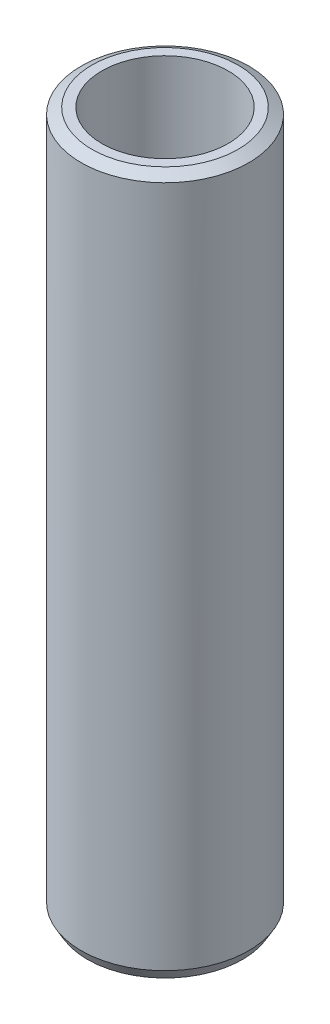
ISO-10303-21;
HEADER;
FILE_DESCRIPTION(('STEP AP214'),'2;1');
FILE_NAME('part.step','',(''),(''),'','','');
FILE_SCHEMA(('AUTOMOTIVE_DESIGN { 1 0 10303 214 1 1 1 1 }'));
ENDSEC;
DATA;
#1=APPLICATION_CONTEXT('core data for automotive mechanical design processes');
#2=APPLICATION_PROTOCOL_DEFINITION('international standard','automotive_design',2000,#1);
#3=PRODUCT_CONTEXT('',#1,'mechanical');
#4=PRODUCT('Part','Part','',(#3));
#5=PRODUCT_RELATED_PRODUCT_CATEGORY('part','',(#4));
#6=PRODUCT_DEFINITION_FORMATION('','',#4);
#7=PRODUCT_DEFINITION_CONTEXT('part definition',#1,'design');
#8=PRODUCT_DEFINITION('design','',#6,#7);
#9=PRODUCT_DEFINITION_SHAPE('','',#8);
#10=(LENGTH_UNIT() NAMED_UNIT(*) SI_UNIT(.MILLI.,.METRE.));
#11=(NAMED_UNIT(*) PLANE_ANGLE_UNIT() SI_UNIT($,.RADIAN.));
#12=(NAMED_UNIT(*) SI_UNIT($,.STERADIAN.) SOLID_ANGLE_UNIT());
#13=UNCERTAINTY_MEASURE_WITH_UNIT(LENGTH_MEASURE(1.E-05),#10,'distance_accuracy_value','');
#14=(GEOMETRIC_REPRESENTATION_CONTEXT(3) GLOBAL_UNCERTAINTY_ASSIGNED_CONTEXT((#13)) GLOBAL_UNIT_ASSIGNED_CONTEXT((#10,
#11,#12)) REPRESENTATION_CONTEXT('',''));
#15=CARTESIAN_POINT('',(0.,0.,0.));
#16=DIRECTION('',(0.,0.,1.));
#17=DIRECTION('',(1.,0.,0.));
#18=AXIS2_PLACEMENT_3D('',#15,#16,#17);
#19=CARTESIAN_POINT('',(0.,479.742255736949,0.));
#20=DIRECTION('',(0.,-1.,0.));
#21=DIRECTION('',(0.,0.,-1.));
#22=AXIS2_PLACEMENT_3D('',#19,#20,#21);
#23=CYLINDRICAL_SURFACE('',#22,57.5);
#24=CARTESIAN_POINT('',(0.,475.494044166921,0.));
#25=DIRECTION('',(0.,1.,0.));
#26=DIRECTION('',(0.,0.,1.));
#27=AXIS2_PLACEMENT_3D('',#24,#25,#26);
#28=CIRCLE('',#27,57.5);
#29=CARTESIAN_POINT('',(0.,475.494044166921,-57.5));
#30=VERTEX_POINT('',#29);
#31=EDGE_CURVE('E50',#30,#30,#28,.F.);
#32=ORIENTED_EDGE('',*,*,#31,.T.);
#33=EDGE_LOOP('',(#32));
#34=FACE_BOUND('',#33,.T.);
#35=CARTESIAN_POINT('',(0.,7.35811828058969,0.));
#36=DIRECTION('',(0.,1.,0.));
#37=DIRECTION('',(0.,0.,1.));
#38=AXIS2_PLACEMENT_3D('',#35,#36,#37);
#39=CIRCLE('',#38,57.5);
#40=CARTESIAN_POINT('',(0.,7.35811828058969,57.5));
#41=VERTEX_POINT('',#40);
#42=EDGE_CURVE('E51',#41,#41,#39,.T.);
#43=ORIENTED_EDGE('',*,*,#42,.T.);
#44=EDGE_LOOP('',(#43));
#45=FACE_BOUND('',#44,.T.);
#46=ADVANCED_FACE('F39',(#34,#45),#23,.T.);
#47=CARTESIAN_POINT('',(0.,479.742255736949,0.));
#48=DIRECTION('',(0.,1.,0.));
#49=DIRECTION('',(0.,0.,1.));
#50=AXIS2_PLACEMENT_3D('',#47,#48,#49);
#51=PLANE('',#50);
#52=CARTESIAN_POINT('',(0.,479.742255736949,0.));
#53=DIRECTION('',(0.,1.,0.));
#54=DIRECTION('',(0.,0.,1.));
#55=AXIS2_PLACEMENT_3D('',#52,#53,#54);
#56=CIRCLE('',#55,50.1418817194105);
#57=CARTESIAN_POINT('',(0.,479.742255736949,-50.1418817194106));
#58=VERTEX_POINT('',#57);
#59=EDGE_CURVE('E54',#58,#58,#56,.T.);
#60=ORIENTED_EDGE('',*,*,#59,.T.);
#61=EDGE_LOOP('',(#60));
#62=FACE_BOUND('',#61,.T.);
#63=CARTESIAN_POINT('',(0.,479.742255736949,0.));
#64=DIRECTION('',(0.,1.,0.));
#65=DIRECTION('',(0.,0.,1.));
#66=AXIS2_PLACEMENT_3D('',#63,#64,#65);
#67=CIRCLE('',#66,43.285910967929);
#68=CARTESIAN_POINT('',(0.,479.742255736949,43.285910967929));
#69=VERTEX_POINT('',#68);
#70=EDGE_CURVE('E58',#69,#69,#67,.T.);
#71=ORIENTED_EDGE('',*,*,#70,.F.);
#72=EDGE_LOOP('',(#71));
#73=FACE_BOUND('',#72,.T.);
#74=ADVANCED_FACE('F69',(#62,#73),#51,.T.);
#75=CARTESIAN_POINT('',(0.,0.,0.));
#76=DIRECTION('',(0.,1.,0.));
#77=DIRECTION('',(0.,0.,1.));
#78=AXIS2_PLACEMENT_3D('',#75,#76,#77);
#79=PLANE('',#78);
#80=CARTESIAN_POINT('',(0.,0.,0.));
#81=DIRECTION('',(0.,1.,0.));
#82=DIRECTION('',(0.,0.,1.));
#83=AXIS2_PLACEMENT_3D('',#80,#81,#82);
#84=CIRCLE('',#83,53.2517884299724);
#85=CARTESIAN_POINT('',(0.,0.,53.2517884299724));
#86=VERTEX_POINT('',#85);
#87=EDGE_CURVE('E10',#86,#86,#84,.F.);
#88=ORIENTED_EDGE('',*,*,#87,.T.);
#89=EDGE_LOOP('',(#88));
#90=FACE_BOUND('',#89,.T.);
#91=CARTESIAN_POINT('',(0.,0.,0.));
#92=DIRECTION('',(0.,1.,0.));
#93=DIRECTION('',(0.,0.,1.));
#94=AXIS2_PLACEMENT_3D('',#91,#92,#93);
#95=CIRCLE('',#94,43.285910967929);
#96=CARTESIAN_POINT('',(0.,0.,43.285910967929));
#97=VERTEX_POINT('',#96);
#98=EDGE_CURVE('E63',#97,#97,#95,.T.);
#99=ORIENTED_EDGE('',*,*,#98,.T.);
#100=EDGE_LOOP('',(#99));
#101=FACE_BOUND('',#100,.T.);
#102=ADVANCED_FACE('F75',(#90,#101),#79,.F.);
#103=CARTESIAN_POINT('',(0.,479.742255736949,0.));
#104=DIRECTION('',(0.,-1.,0.));
#105=DIRECTION('',(0.,0.,-1.));
#106=AXIS2_PLACEMENT_3D('',#103,#104,#105);
#107=CYLINDRICAL_SURFACE('',#106,43.285910967929);
#108=ORIENTED_EDGE('',*,*,#70,.T.);
#109=EDGE_LOOP('',(#108));
#110=FACE_BOUND('',#109,.T.);
#111=ORIENTED_EDGE('',*,*,#98,.F.);
#112=EDGE_LOOP('',(#111));
#113=FACE_BOUND('',#112,.T.);
#114=ADVANCED_FACE('F70',(#110,#113),#107,.F.);
#115=CARTESIAN_POINT('',(0.,479.742255736949,0.));
#116=DIRECTION('',(0.,-1.,0.));
#117=DIRECTION('',(0.,0.,-1.));
#118=AXIS2_PLACEMENT_3D('',#115,#116,#117);
#119=CONICAL_SURFACE('',#118,50.1418817194105,1.04719755119659);
#120=CARTESIAN_POINT('',(0.,475.494044166921,-57.5));
#121=CARTESIAN_POINT('',(0.,475.538296370776,-57.4233529345772));
#122=CARTESIAN_POINT('',(0.,475.58254857463,-57.3467058691544));
#123=CARTESIAN_POINT('',(0.,475.671052982339,-57.1934117383088));
#124=CARTESIAN_POINT('',(0.,475.715305186193,-57.116764672886));
#125=CARTESIAN_POINT('',(0.,475.803809593902,-56.9634705420404));
#126=CARTESIAN_POINT('',(0.,475.848061797757,-56.8868234766176));
#127=CARTESIAN_POINT('',(0.,475.936566205466,-56.733529345772));
#128=CARTESIAN_POINT('',(0.,475.98081840932,-56.6568822803492));
#129=CARTESIAN_POINT('',(0.,476.069322817029,-56.5035881495036));
#130=CARTESIAN_POINT('',(0.,476.113575020883,-56.4269410840808));
#131=CARTESIAN_POINT('',(0.,476.202079428592,-56.2736469532351));
#132=CARTESIAN_POINT('',(0.,476.246331632447,-56.1969998878123));
#133=CARTESIAN_POINT('',(0.,476.334836040156,-56.0437057569667));
#134=CARTESIAN_POINT('',(0.,476.37908824401,-55.9670586915439));
#135=CARTESIAN_POINT('',(0.,476.467592651719,-55.8137645606983));
#136=CARTESIAN_POINT('',(0.,476.511844855574,-55.7371174952755));
#137=CARTESIAN_POINT('',(0.,476.600349263283,-55.5838233644299));
#138=CARTESIAN_POINT('',(0.,476.644601467137,-55.5071762990071));
#139=CARTESIAN_POINT('',(0.,476.733105874846,-55.3538821681614));
#140=CARTESIAN_POINT('',(0.,476.7773580787,-55.2772351027386));
#141=CARTESIAN_POINT('',(0.,476.865862486409,-55.123940971893));
#142=CARTESIAN_POINT('',(0.,476.910114690264,-55.0472939064702));
#143=CARTESIAN_POINT('',(0.,476.998619097973,-54.8939997756246));
#144=CARTESIAN_POINT('',(0.,477.042871301827,-54.8173527102018));
#145=CARTESIAN_POINT('',(0.,477.131375709536,-54.6640585793562));
#146=CARTESIAN_POINT('',(0.,477.17562791339,-54.5874115139334));
#147=CARTESIAN_POINT('',(0.,477.264132321099,-54.4341173830878));
#148=CARTESIAN_POINT('',(0.,477.308384524954,-54.357470317665));
#149=CARTESIAN_POINT('',(0.,477.396888932663,-54.2041761868194));
#150=CARTESIAN_POINT('',(0.,477.441141136517,-54.1275291213965));
#151=CARTESIAN_POINT('',(0.,477.529645544226,-53.9742349905509));
#152=CARTESIAN_POINT('',(0.,477.57389774808,-53.8975879251281));
#153=CARTESIAN_POINT('',(0.,477.662402155789,-53.7442937942825));
#154=CARTESIAN_POINT('',(0.,477.706654359644,-53.6676467288597));
#155=CARTESIAN_POINT('',(0.,477.795158767353,-53.5143525980141));
#156=CARTESIAN_POINT('',(0.,477.839410971207,-53.4377055325913));
#157=CARTESIAN_POINT('',(0.,477.927915378916,-53.2844114017457));
#158=CARTESIAN_POINT('',(0.,477.972167582771,-53.2077643363228));
#159=CARTESIAN_POINT('',(0.,478.060671990479,-53.0544702054772));
#160=CARTESIAN_POINT('',(0.,478.104924194334,-52.9778231400544));
#161=CARTESIAN_POINT('',(0.,478.193428602043,-52.8245290092088));
#162=CARTESIAN_POINT('',(0.,478.237680805897,-52.747881943786));
#163=CARTESIAN_POINT('',(0.,478.326185213606,-52.5945878129404));
#164=CARTESIAN_POINT('',(0.,478.370437417461,-52.5179407475176));
#165=CARTESIAN_POINT('',(0.,478.45894182517,-52.364646616672));
#166=CARTESIAN_POINT('',(0.,478.503194029024,-52.2879995512492));
#167=CARTESIAN_POINT('',(0.,478.591698436733,-52.1347054204036));
#168=CARTESIAN_POINT('',(0.,478.635950640587,-52.0580583549808));
#169=CARTESIAN_POINT('',(0.,478.724455048296,-51.9047642241351));
#170=CARTESIAN_POINT('',(0.,478.768707252151,-51.8281171587123));
#171=CARTESIAN_POINT('',(0.,478.85721165986,-51.6748230278667));
#172=CARTESIAN_POINT('',(0.,478.901463863714,-51.5981759624439));
#173=CARTESIAN_POINT('',(0.,478.989968271423,-51.4448818315983));
#174=CARTESIAN_POINT('',(0.,479.034220475277,-51.3682347661755));
#175=CARTESIAN_POINT('',(0.,479.122724882986,-51.2149406353299));
#176=CARTESIAN_POINT('',(0.,479.166977086841,-51.1382935699071));
#177=CARTESIAN_POINT('',(0.,479.25548149455,-50.9849994390614));
#178=CARTESIAN_POINT('',(0.,479.299733698404,-50.9083523736386));
#179=CARTESIAN_POINT('',(0.,479.388238106113,-50.755058242793));
#180=CARTESIAN_POINT('',(0.,479.432490309967,-50.6784111773702));
#181=CARTESIAN_POINT('',(0.,479.520994717676,-50.5251170465246));
#182=CARTESIAN_POINT('',(0.,479.565246921531,-50.4484699811018));
#183=CARTESIAN_POINT('',(0.,479.65375132924,-50.2951758502562));
#184=CARTESIAN_POINT('',(0.,479.698003533094,-50.2185287848334));
#185=CARTESIAN_POINT('',(0.,479.742255736949,-50.1418817194106));
#186=B_SPLINE_CURVE_WITH_KNOTS('',3,(#120,#121,#122,#123,#124,#125,#126,#127,#128,#129,#130,
#131,#132,#133,#134,#135,#136,#137,#138,#139,#140,#141,#142,#143,#144,#145,#146,#147,#148,#149,
#150,#151,#152,#153,#154,#155,#156,#157,#158,#159,#160,#161,#162,#163,#164,#165,#166,#167,#168,
#169,#170,#171,#172,#173,#174,#175,#176,#177,#178,#179,#180,#181,#182,#183,#184,#185),
.UNSPECIFIED.,.F.,.F.,(4,2,2,2,2,2,2,2,2,2,2,2,2,2,2,2,2,2,2,2,2,2,2,2,2,2,2,2,2,2,2,2,4),(0.,
0.265513223126693,0.531026446253414,0.796539669380129,1.06205289250685,1.32756611563357,
1.59307933876029,1.85859256188701,2.12410578501373,2.38961900814042,2.65513223126714,
2.92064545439386,3.18615867752058,3.45167190064731,3.71718512377402,3.98269834690074,
4.24821157002746,4.51372479315416,4.77923801628088,5.0447512394076,5.31026446253431,
5.57577768566104,5.84129090878776,6.10680413191448,6.3723173550412,6.63783057816789,
6.90334380129461,7.16885702442133,7.43437024754805,7.69988347067477,7.96539669380149,
8.23090991692821,8.49642314005493),.UNSPECIFIED.);
#187=EDGE_CURVE('BSEAM81',#30,#58,#186,.T.);
#188=ORIENTED_EDGE('',*,*,#31,.F.);
#189=ORIENTED_EDGE('',*,*,#59,.F.);
#190=ORIENTED_EDGE('',*,*,#187,.T.);
#191=ORIENTED_EDGE('',*,*,#187,.F.);
#192=EDGE_LOOP('',(#188,#190,#189,#191));
#193=FACE_BOUND('',#192,.T.);
#194=ADVANCED_FACE('F81',(#193),#119,.T.);
#195=CARTESIAN_POINT('',(0.,7.35811828058969,0.));
#196=DIRECTION('',(0.,1.,0.));
#197=DIRECTION('',(0.,0.,1.));
#198=AXIS2_PLACEMENT_3D('',#195,#196,#197);
#199=CONICAL_SURFACE('',#198,57.5,0.523598775598304);
#200=ORIENTED_EDGE('',*,*,#87,.F.);
#201=EDGE_LOOP('',(#200));
#202=FACE_BOUND('',#201,.T.);
#203=ORIENTED_EDGE('',*,*,#42,.F.);
#204=EDGE_LOOP('',(#203));
#205=FACE_BOUND('',#204,.T.);
#206=ADVANCED_FACE('F45',(#202,#205),#199,.T.);
#207=CLOSED_SHELL('',(#46,#74,#102,#114,#194,#206));
#208=MANIFOLD_SOLID_BREP('B2',#207);
#209=ADVANCED_BREP_SHAPE_REPRESENTATION('',(#18,#208),#14);
#210=SHAPE_DEFINITION_REPRESENTATION(#9,#209);
ENDSEC;
END-ISO-10303-21;
